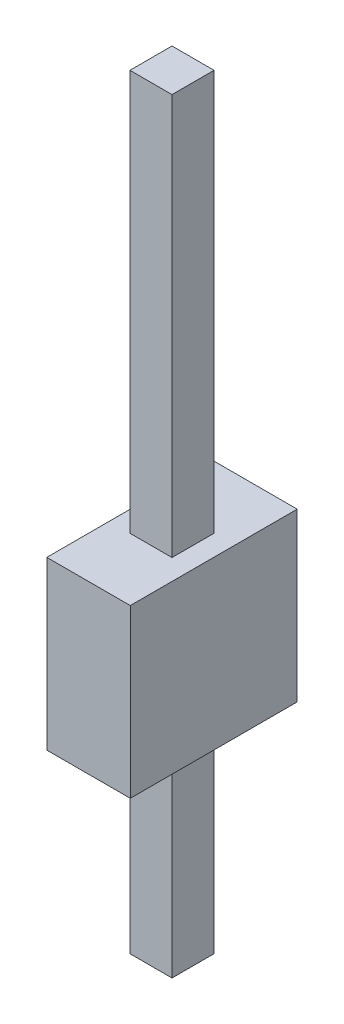
ISO-10303-21;
HEADER;
FILE_DESCRIPTION(('STEP AP214'),'2;1');
FILE_NAME('part.step','',(''),(''),'','','');
FILE_SCHEMA(('AUTOMOTIVE_DESIGN { 1 0 10303 214 1 1 1 1 }'));
ENDSEC;
DATA;
#1=APPLICATION_CONTEXT('core data for automotive mechanical design processes');
#2=APPLICATION_PROTOCOL_DEFINITION('international standard','automotive_design',2000,#1);
#3=PRODUCT_CONTEXT('',#1,'mechanical');
#4=PRODUCT('Part','Part','',(#3));
#5=PRODUCT_RELATED_PRODUCT_CATEGORY('part','',(#4));
#6=PRODUCT_DEFINITION_FORMATION('','',#4);
#7=PRODUCT_DEFINITION_CONTEXT('part definition',#1,'design');
#8=PRODUCT_DEFINITION('design','',#6,#7);
#9=PRODUCT_DEFINITION_SHAPE('','',#8);
#10=(LENGTH_UNIT() NAMED_UNIT(*) SI_UNIT(.MILLI.,.METRE.));
#11=(NAMED_UNIT(*) PLANE_ANGLE_UNIT() SI_UNIT($,.RADIAN.));
#12=(NAMED_UNIT(*) SI_UNIT($,.STERADIAN.) SOLID_ANGLE_UNIT());
#13=UNCERTAINTY_MEASURE_WITH_UNIT(LENGTH_MEASURE(1.E-05),#10,'distance_accuracy_value','');
#14=(GEOMETRIC_REPRESENTATION_CONTEXT(3) GLOBAL_UNCERTAINTY_ASSIGNED_CONTEXT((#13)) GLOBAL_UNIT_ASSIGNED_CONTEXT((#10,
#11,#12)) REPRESENTATION_CONTEXT('',''));
#15=CARTESIAN_POINT('',(0.,0.,0.));
#16=DIRECTION('',(0.,0.,1.));
#17=DIRECTION('',(1.,0.,0.));
#18=AXIS2_PLACEMENT_3D('',#15,#16,#17);
#19=CARTESIAN_POINT('',(0.,2.54,0.));
#20=DIRECTION('',(1.,0.,0.));
#21=DIRECTION('',(0.,0.,-1.));
#22=AXIS2_PLACEMENT_3D('',#19,#20,#21);
#23=PLANE('',#22);
#24=DIRECTION('',(0.,0.,1.));
#25=VECTOR('',#24,1.);
#26=CARTESIAN_POINT('',(0.,0.,0.));
#27=LINE('',#26,#25);
#28=CARTESIAN_POINT('',(0.,0.,-2.54));
#29=VERTEX_POINT('',#28);
#30=CARTESIAN_POINT('',(0.,0.,0.));
#31=VERTEX_POINT('',#30);
#32=EDGE_CURVE('E210',#29,#31,#27,.T.);
#33=ORIENTED_EDGE('',*,*,#32,.T.);
#34=DIRECTION('',(0.,-1.,0.));
#35=VECTOR('',#34,1.);
#36=CARTESIAN_POINT('',(0.,2.54,0.));
#37=LINE('',#36,#35);
#38=CARTESIAN_POINT('',(0.,2.54,0.));
#39=VERTEX_POINT('',#38);
#40=EDGE_CURVE('E248',#39,#31,#37,.T.);
#41=ORIENTED_EDGE('',*,*,#40,.F.);
#42=DIRECTION('',(0.,0.,1.));
#43=VECTOR('',#42,1.);
#44=CARTESIAN_POINT('',(0.,2.54,0.));
#45=LINE('',#44,#43);
#46=CARTESIAN_POINT('',(0.,2.54,-2.54));
#47=VERTEX_POINT('',#46);
#48=EDGE_CURVE('E211',#47,#39,#45,.T.);
#49=ORIENTED_EDGE('',*,*,#48,.F.);
#50=DIRECTION('',(0.,-1.,0.));
#51=VECTOR('',#50,1.);
#52=CARTESIAN_POINT('',(0.,2.54,-2.54));
#53=LINE('',#52,#51);
#54=EDGE_CURVE('E225',#47,#29,#53,.T.);
#55=ORIENTED_EDGE('',*,*,#54,.T.);
#56=EDGE_LOOP('',(#33,#41,#49,#55));
#57=FACE_BOUND('',#56,.T.);
#58=ADVANCED_FACE('F47',(#57),#23,.F.);
#59=CARTESIAN_POINT('',(0.,2.54,0.));
#60=DIRECTION('',(0.,0.,-1.));
#61=DIRECTION('',(-1.,0.,0.));
#62=AXIS2_PLACEMENT_3D('',#59,#60,#61);
#63=PLANE('',#62);
#64=DIRECTION('',(1.,0.,0.));
#65=VECTOR('',#64,1.);
#66=CARTESIAN_POINT('',(0.,0.,0.));
#67=LINE('',#66,#65);
#68=CARTESIAN_POINT('',(1.27,0.,0.));
#69=VERTEX_POINT('',#68);
#70=EDGE_CURVE('E229',#31,#69,#67,.T.);
#71=ORIENTED_EDGE('',*,*,#70,.T.);
#72=DIRECTION('',(0.,-1.,0.));
#73=VECTOR('',#72,1.);
#74=CARTESIAN_POINT('',(1.27,2.54,0.));
#75=LINE('',#74,#73);
#76=CARTESIAN_POINT('',(1.27,2.54,0.));
#77=VERTEX_POINT('',#76);
#78=EDGE_CURVE('E244',#77,#69,#75,.T.);
#79=ORIENTED_EDGE('',*,*,#78,.F.);
#80=DIRECTION('',(1.,0.,0.));
#81=VECTOR('',#80,1.);
#82=CARTESIAN_POINT('',(0.,2.54,0.));
#83=LINE('',#82,#81);
#84=EDGE_CURVE('E215',#39,#77,#83,.T.);
#85=ORIENTED_EDGE('',*,*,#84,.F.);
#86=ORIENTED_EDGE('',*,*,#40,.T.);
#87=EDGE_LOOP('',(#71,#79,#85,#86));
#88=FACE_BOUND('',#87,.T.);
#89=ADVANCED_FACE('F295',(#88),#63,.F.);
#90=CARTESIAN_POINT('',(1.27,2.54,0.));
#91=DIRECTION('',(-1.,0.,0.));
#92=DIRECTION('',(0.,0.,1.));
#93=AXIS2_PLACEMENT_3D('',#90,#91,#92);
#94=PLANE('',#93);
#95=DIRECTION('',(0.,0.,-1.));
#96=VECTOR('',#95,1.);
#97=CARTESIAN_POINT('',(1.27,0.,0.));
#98=LINE('',#97,#96);
#99=CARTESIAN_POINT('',(1.27,0.,-2.54));
#100=VERTEX_POINT('',#99);
#101=EDGE_CURVE('E232',#69,#100,#98,.T.);
#102=ORIENTED_EDGE('',*,*,#101,.T.);
#103=DIRECTION('',(0.,-1.,0.));
#104=VECTOR('',#103,1.);
#105=CARTESIAN_POINT('',(1.27,2.54,-2.54));
#106=LINE('',#105,#104);
#107=CARTESIAN_POINT('',(1.27,2.54,-2.54));
#108=VERTEX_POINT('',#107);
#109=EDGE_CURVE('E240',#108,#100,#106,.T.);
#110=ORIENTED_EDGE('',*,*,#109,.F.);
#111=DIRECTION('',(0.,0.,-1.));
#112=VECTOR('',#111,1.);
#113=CARTESIAN_POINT('',(1.27,2.54,0.));
#114=LINE('',#113,#112);
#115=EDGE_CURVE('E219',#77,#108,#114,.T.);
#116=ORIENTED_EDGE('',*,*,#115,.F.);
#117=ORIENTED_EDGE('',*,*,#78,.T.);
#118=EDGE_LOOP('',(#102,#110,#116,#117));
#119=FACE_BOUND('',#118,.T.);
#120=ADVANCED_FACE('F292',(#119),#94,.F.);
#121=CARTESIAN_POINT('',(0.,2.54,-2.54));
#122=DIRECTION('',(0.,0.,1.));
#123=DIRECTION('',(1.,0.,0.));
#124=AXIS2_PLACEMENT_3D('',#121,#122,#123);
#125=PLANE('',#124);
#126=DIRECTION('',(-1.,0.,0.));
#127=VECTOR('',#126,1.);
#128=CARTESIAN_POINT('',(0.,0.,-2.54));
#129=LINE('',#128,#127);
#130=EDGE_CURVE('E216',#100,#29,#129,.T.);
#131=ORIENTED_EDGE('',*,*,#130,.T.);
#132=ORIENTED_EDGE('',*,*,#54,.F.);
#133=DIRECTION('',(-1.,0.,0.));
#134=VECTOR('',#133,1.);
#135=CARTESIAN_POINT('',(0.,2.54,-2.54));
#136=LINE('',#135,#134);
#137=EDGE_CURVE('E222',#108,#47,#136,.T.);
#138=ORIENTED_EDGE('',*,*,#137,.F.);
#139=ORIENTED_EDGE('',*,*,#109,.T.);
#140=EDGE_LOOP('',(#131,#132,#138,#139));
#141=FACE_BOUND('',#140,.T.);
#142=ADVANCED_FACE('F288',(#141),#125,.F.);
#143=CARTESIAN_POINT('',(0.,2.54,0.));
#144=DIRECTION('',(0.,-1.,0.));
#145=DIRECTION('',(0.,0.,-1.));
#146=AXIS2_PLACEMENT_3D('',#143,#144,#145);
#147=PLANE('',#146);
#148=DIRECTION('',(0.,0.,1.));
#149=VECTOR('',#148,1.);
#150=CARTESIAN_POINT('',(0.955,2.54,0.));
#151=LINE('',#150,#149);
#152=CARTESIAN_POINT('',(0.955,2.54,-1.59));
#153=VERTEX_POINT('',#152);
#154=CARTESIAN_POINT('',(0.955,2.54,-0.95));
#155=VERTEX_POINT('',#154);
#156=EDGE_CURVE('E203',#153,#155,#151,.T.);
#157=ORIENTED_EDGE('',*,*,#156,.T.);
#158=DIRECTION('',(-1.,0.,0.));
#159=VECTOR('',#158,1.);
#160=CARTESIAN_POINT('',(0.,2.54,-0.95));
#161=LINE('',#160,#159);
#162=CARTESIAN_POINT('',(0.315,2.54,-0.95));
#163=VERTEX_POINT('',#162);
#164=EDGE_CURVE('E207',#155,#163,#161,.T.);
#165=ORIENTED_EDGE('',*,*,#164,.T.);
#166=DIRECTION('',(0.,0.,-1.));
#167=VECTOR('',#166,1.);
#168=CARTESIAN_POINT('',(0.315,2.54,0.));
#169=LINE('',#168,#167);
#170=CARTESIAN_POINT('',(0.315,2.54,-1.59));
#171=VERTEX_POINT('',#170);
#172=EDGE_CURVE('E138',#163,#171,#169,.T.);
#173=ORIENTED_EDGE('',*,*,#172,.T.);
#174=DIRECTION('',(1.,0.,0.));
#175=VECTOR('',#174,1.);
#176=CARTESIAN_POINT('',(0.,2.54,-1.59));
#177=LINE('',#176,#175);
#178=EDGE_CURVE('E199',#171,#153,#177,.T.);
#179=ORIENTED_EDGE('',*,*,#178,.T.);
#180=EDGE_LOOP('',(#157,#165,#173,#179));
#181=FACE_BOUND('',#180,.T.);
#182=ORIENTED_EDGE('',*,*,#48,.T.);
#183=ORIENTED_EDGE('',*,*,#84,.T.);
#184=ORIENTED_EDGE('',*,*,#115,.T.);
#185=ORIENTED_EDGE('',*,*,#137,.T.);
#186=EDGE_LOOP('',(#182,#183,#184,#185));
#187=FACE_BOUND('',#186,.T.);
#188=ADVANCED_FACE('F277',(#181,#187),#147,.F.);
#189=CARTESIAN_POINT('',(0.,0.,0.));
#190=DIRECTION('',(0.,-1.,0.));
#191=DIRECTION('',(0.,0.,-1.));
#192=AXIS2_PLACEMENT_3D('',#189,#190,#191);
#193=PLANE('',#192);
#194=DIRECTION('',(-1.,0.,0.));
#195=VECTOR('',#194,1.);
#196=CARTESIAN_POINT('',(0.,0.,-0.95));
#197=LINE('',#196,#195);
#198=CARTESIAN_POINT('',(0.955,0.,-0.95));
#199=VERTEX_POINT('',#198);
#200=CARTESIAN_POINT('',(0.315,0.,-0.95));
#201=VERTEX_POINT('',#200);
#202=EDGE_CURVE('E12',#199,#201,#197,.T.);
#203=ORIENTED_EDGE('',*,*,#202,.F.);
#204=DIRECTION('',(0.,0.,1.));
#205=VECTOR('',#204,1.);
#206=CARTESIAN_POINT('',(0.955,0.,0.));
#207=LINE('',#206,#205);
#208=CARTESIAN_POINT('',(0.955,0.,-1.59));
#209=VERTEX_POINT('',#208);
#210=EDGE_CURVE('E55',#209,#199,#207,.T.);
#211=ORIENTED_EDGE('',*,*,#210,.F.);
#212=DIRECTION('',(1.,0.,0.));
#213=VECTOR('',#212,1.);
#214=CARTESIAN_POINT('',(0.,0.,-1.59));
#215=LINE('',#214,#213);
#216=CARTESIAN_POINT('',(0.315,0.,-1.59));
#217=VERTEX_POINT('',#216);
#218=EDGE_CURVE('E256',#217,#209,#215,.T.);
#219=ORIENTED_EDGE('',*,*,#218,.F.);
#220=DIRECTION('',(0.,0.,-1.));
#221=VECTOR('',#220,1.);
#222=CARTESIAN_POINT('',(0.315,0.,0.));
#223=LINE('',#222,#221);
#224=EDGE_CURVE('E252',#201,#217,#223,.T.);
#225=ORIENTED_EDGE('',*,*,#224,.F.);
#226=EDGE_LOOP('',(#203,#211,#219,#225));
#227=FACE_BOUND('',#226,.T.);
#228=ORIENTED_EDGE('',*,*,#32,.F.);
#229=ORIENTED_EDGE('',*,*,#130,.F.);
#230=ORIENTED_EDGE('',*,*,#101,.F.);
#231=ORIENTED_EDGE('',*,*,#70,.F.);
#232=EDGE_LOOP('',(#228,#229,#230,#231));
#233=FACE_BOUND('',#232,.T.);
#234=ADVANCED_FACE('F274',(#227,#233),#193,.T.);
#235=CARTESIAN_POINT('',(0.,-3.,0.));
#236=DIRECTION('',(0.,-1.,0.));
#237=DIRECTION('',(0.,0.,-1.));
#238=AXIS2_PLACEMENT_3D('',#235,#236,#237);
#239=PLANE('',#238);
#240=DIRECTION('',(0.,0.,1.));
#241=VECTOR('',#240,1.);
#242=CARTESIAN_POINT('',(0.315,-3.,-1.59));
#243=LINE('',#242,#241);
#244=CARTESIAN_POINT('',(0.315,-3.,-1.59));
#245=VERTEX_POINT('',#244);
#246=CARTESIAN_POINT('',(0.315,-3.,-0.95));
#247=VERTEX_POINT('',#246);
#248=EDGE_CURVE('E143',#245,#247,#243,.T.);
#249=ORIENTED_EDGE('',*,*,#248,.F.);
#250=DIRECTION('',(-1.,0.,0.));
#251=VECTOR('',#250,1.);
#252=CARTESIAN_POINT('',(0.315,-3.,-1.59));
#253=LINE('',#252,#251);
#254=CARTESIAN_POINT('',(0.955,-3.,-1.59));
#255=VERTEX_POINT('',#254);
#256=EDGE_CURVE('E175',#255,#245,#253,.T.);
#257=ORIENTED_EDGE('',*,*,#256,.F.);
#258=DIRECTION('',(0.,0.,-1.));
#259=VECTOR('',#258,1.);
#260=CARTESIAN_POINT('',(0.955,-3.,-1.59));
#261=LINE('',#260,#259);
#262=CARTESIAN_POINT('',(0.955,-3.,-0.95));
#263=VERTEX_POINT('',#262);
#264=EDGE_CURVE('E180',#263,#255,#261,.T.);
#265=ORIENTED_EDGE('',*,*,#264,.F.);
#266=DIRECTION('',(1.,0.,0.));
#267=VECTOR('',#266,1.);
#268=CARTESIAN_POINT('',(0.315,-3.,-0.95));
#269=LINE('',#268,#267);
#270=EDGE_CURVE('E167',#247,#263,#269,.T.);
#271=ORIENTED_EDGE('',*,*,#270,.F.);
#272=EDGE_LOOP('',(#249,#257,#265,#271));
#273=FACE_BOUND('',#272,.T.);
#274=ADVANCED_FACE('F268',(#273),#239,.T.);
#275=CARTESIAN_POINT('',(0.315,-6.90509667991878,-1.59));
#276=DIRECTION('',(-1.,0.,0.));
#277=DIRECTION('',(0.,0.,1.));
#278=AXIS2_PLACEMENT_3D('',#275,#276,#277);
#279=PLANE('',#278);
#280=DIRECTION('',(0.,1.,0.));
#281=VECTOR('',#280,1.);
#282=CARTESIAN_POINT('',(0.315,-6.90509667991878,-0.95));
#283=LINE('',#282,#281);
#284=EDGE_CURVE('E142',#247,#201,#283,.T.);
#285=ORIENTED_EDGE('',*,*,#284,.T.);
#286=ORIENTED_EDGE('',*,*,#224,.T.);
#287=DIRECTION('',(0.,1.,0.));
#288=VECTOR('',#287,1.);
#289=CARTESIAN_POINT('',(0.315,-6.90509667991878,-1.59));
#290=LINE('',#289,#288);
#291=EDGE_CURVE('E174',#245,#217,#290,.T.);
#292=ORIENTED_EDGE('',*,*,#291,.F.);
#293=ORIENTED_EDGE('',*,*,#248,.T.);
#294=EDGE_LOOP('',(#285,#286,#292,#293));
#295=FACE_BOUND('',#294,.T.);
#296=ADVANCED_FACE('F271',(#295),#279,.T.);
#297=CARTESIAN_POINT('',(0.315,-6.90509667991878,-1.59));
#298=DIRECTION('',(0.,0.,-1.));
#299=DIRECTION('',(-1.,0.,0.));
#300=AXIS2_PLACEMENT_3D('',#297,#298,#299);
#301=PLANE('',#300);
#302=ORIENTED_EDGE('',*,*,#291,.T.);
#303=ORIENTED_EDGE('',*,*,#218,.T.);
#304=DIRECTION('',(0.,1.,0.));
#305=VECTOR('',#304,1.);
#306=CARTESIAN_POINT('',(0.955,-6.90509667991878,-1.59));
#307=LINE('',#306,#305);
#308=EDGE_CURVE('E179',#255,#209,#307,.T.);
#309=ORIENTED_EDGE('',*,*,#308,.F.);
#310=ORIENTED_EDGE('',*,*,#256,.T.);
#311=EDGE_LOOP('',(#302,#303,#309,#310));
#312=FACE_BOUND('',#311,.T.);
#313=ADVANCED_FACE('F273',(#312),#301,.T.);
#314=CARTESIAN_POINT('',(0.955,-6.90509667991878,-1.59));
#315=DIRECTION('',(1.,0.,0.));
#316=DIRECTION('',(0.,0.,-1.));
#317=AXIS2_PLACEMENT_3D('',#314,#315,#316);
#318=PLANE('',#317);
#319=ORIENTED_EDGE('',*,*,#308,.T.);
#320=ORIENTED_EDGE('',*,*,#210,.T.);
#321=DIRECTION('',(0.,1.,0.));
#322=VECTOR('',#321,1.);
#323=CARTESIAN_POINT('',(0.955,-6.90509667991878,-0.95));
#324=LINE('',#323,#322);
#325=EDGE_CURVE('E185',#263,#199,#324,.T.);
#326=ORIENTED_EDGE('',*,*,#325,.F.);
#327=ORIENTED_EDGE('',*,*,#264,.T.);
#328=EDGE_LOOP('',(#319,#320,#326,#327));
#329=FACE_BOUND('',#328,.T.);
#330=ADVANCED_FACE('F262',(#329),#318,.T.);
#331=CARTESIAN_POINT('',(0.315,-6.90509667991878,-0.95));
#332=DIRECTION('',(0.,0.,1.));
#333=DIRECTION('',(1.,0.,0.));
#334=AXIS2_PLACEMENT_3D('',#331,#332,#333);
#335=PLANE('',#334);
#336=ORIENTED_EDGE('',*,*,#325,.T.);
#337=ORIENTED_EDGE('',*,*,#202,.T.);
#338=ORIENTED_EDGE('',*,*,#284,.F.);
#339=ORIENTED_EDGE('',*,*,#270,.T.);
#340=EDGE_LOOP('',(#336,#337,#338,#339));
#341=FACE_BOUND('',#340,.T.);
#342=ADVANCED_FACE('F265',(#341),#335,.T.);
#343=ORIENTED_EDGE('',*,*,#164,.F.);
#344=CARTESIAN_POINT('',(0.955,8.64,-0.95));
#345=VERTEX_POINT('',#344);
#346=EDGE_CURVE('E149',#155,#345,#324,.T.);
#347=ORIENTED_EDGE('',*,*,#346,.T.);
#348=DIRECTION('',(1.,0.,0.));
#349=VECTOR('',#348,1.);
#350=CARTESIAN_POINT('',(0.315,8.64,-0.95));
#351=LINE('',#350,#349);
#352=CARTESIAN_POINT('',(0.315,8.64,-0.95));
#353=VERTEX_POINT('',#352);
#354=EDGE_CURVE('E146',#353,#345,#351,.T.);
#355=ORIENTED_EDGE('',*,*,#354,.F.);
#356=EDGE_CURVE('E132',#163,#353,#283,.T.);
#357=ORIENTED_EDGE('',*,*,#356,.F.);
#358=EDGE_LOOP('',(#343,#347,#355,#357));
#359=FACE_BOUND('',#358,.T.);
#360=ADVANCED_FACE('F147',(#359),#335,.T.);
#361=ORIENTED_EDGE('',*,*,#156,.F.);
#362=CARTESIAN_POINT('',(0.955,8.64,-1.59));
#363=VERTEX_POINT('',#362);
#364=EDGE_CURVE('E184',#153,#363,#307,.T.);
#365=ORIENTED_EDGE('',*,*,#364,.T.);
#366=DIRECTION('',(0.,0.,-1.));
#367=VECTOR('',#366,1.);
#368=CARTESIAN_POINT('',(0.955,8.64,-1.59));
#369=LINE('',#368,#367);
#370=EDGE_CURVE('E154',#345,#363,#369,.T.);
#371=ORIENTED_EDGE('',*,*,#370,.F.);
#372=ORIENTED_EDGE('',*,*,#346,.F.);
#373=EDGE_LOOP('',(#361,#365,#371,#372));
#374=FACE_BOUND('',#373,.T.);
#375=ADVANCED_FACE('F355',(#374),#318,.T.);
#376=ORIENTED_EDGE('',*,*,#178,.F.);
#377=CARTESIAN_POINT('',(0.315,8.64,-1.59));
#378=VERTEX_POINT('',#377);
#379=EDGE_CURVE('E62',#171,#378,#290,.T.);
#380=ORIENTED_EDGE('',*,*,#379,.T.);
#381=DIRECTION('',(-1.,0.,0.));
#382=VECTOR('',#381,1.);
#383=CARTESIAN_POINT('',(0.315,8.64,-1.59));
#384=LINE('',#383,#382);
#385=EDGE_CURVE('E159',#363,#378,#384,.T.);
#386=ORIENTED_EDGE('',*,*,#385,.F.);
#387=ORIENTED_EDGE('',*,*,#364,.F.);
#388=EDGE_LOOP('',(#376,#380,#386,#387));
#389=FACE_BOUND('',#388,.T.);
#390=ADVANCED_FACE('F348',(#389),#301,.T.);
#391=ORIENTED_EDGE('',*,*,#172,.F.);
#392=ORIENTED_EDGE('',*,*,#356,.T.);
#393=DIRECTION('',(0.,0.,1.));
#394=VECTOR('',#393,1.);
#395=CARTESIAN_POINT('',(0.315,8.64,-1.59));
#396=LINE('',#395,#394);
#397=EDGE_CURVE('E136',#378,#353,#396,.T.);
#398=ORIENTED_EDGE('',*,*,#397,.F.);
#399=ORIENTED_EDGE('',*,*,#379,.F.);
#400=EDGE_LOOP('',(#391,#392,#398,#399));
#401=FACE_BOUND('',#400,.T.);
#402=ADVANCED_FACE('F134',(#401),#279,.T.);
#403=CARTESIAN_POINT('',(0.,8.64,0.));
#404=DIRECTION('',(0.,1.,0.));
#405=DIRECTION('',(0.,0.,1.));
#406=AXIS2_PLACEMENT_3D('',#403,#404,#405);
#407=PLANE('',#406);
#408=ORIENTED_EDGE('',*,*,#397,.T.);
#409=ORIENTED_EDGE('',*,*,#354,.T.);
#410=ORIENTED_EDGE('',*,*,#370,.T.);
#411=ORIENTED_EDGE('',*,*,#385,.T.);
#412=EDGE_LOOP('',(#408,#409,#410,#411));
#413=FACE_BOUND('',#412,.T.);
#414=ADVANCED_FACE('F157',(#413),#407,.T.);
#415=CLOSED_SHELL('',(#58,#89,#120,#142,#188,#234,#274,#296,#313,#330,#342,#360,#375,#390,#402,#414));
#416=MANIFOLD_SOLID_BREP('B2',#415);
#417=ADVANCED_BREP_SHAPE_REPRESENTATION('',(#18,#416),#14);
#418=SHAPE_DEFINITION_REPRESENTATION(#9,#417);
ENDSEC;
END-ISO-10303-21;
